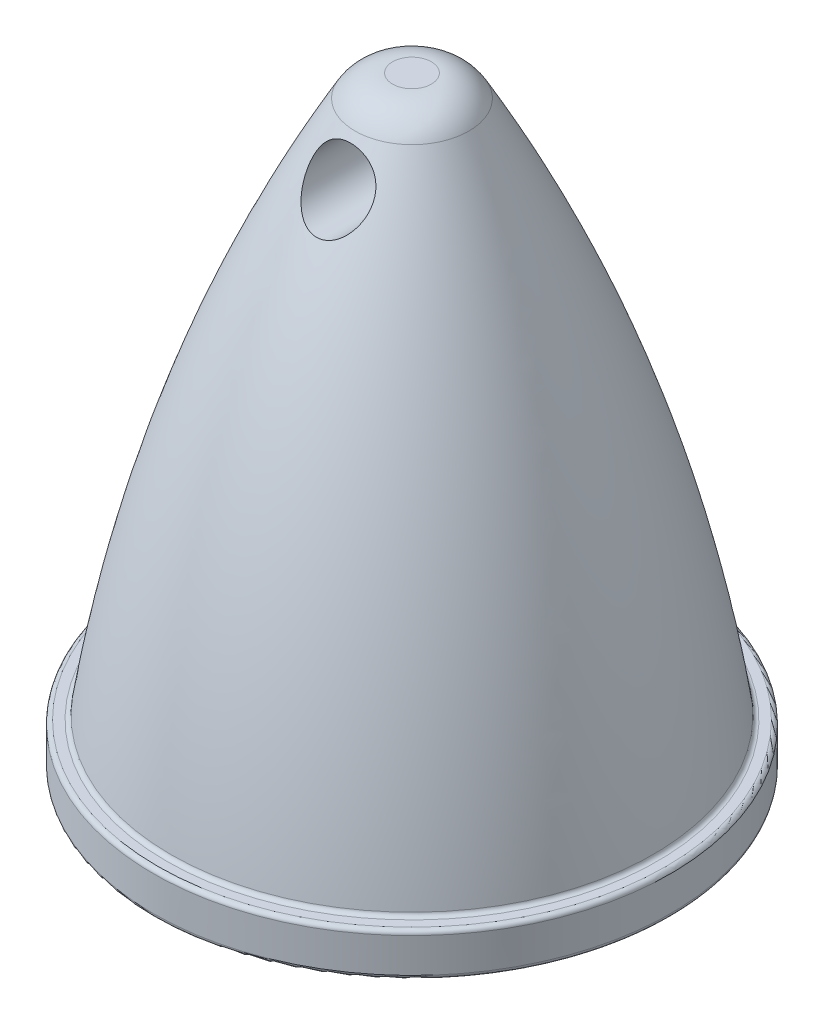
ISO-10303-21;
HEADER;
FILE_DESCRIPTION(('STEP AP214'),'2;1');
FILE_NAME('part.step','',(''),(''),'','','');
FILE_SCHEMA(('AUTOMOTIVE_DESIGN { 1 0 10303 214 1 1 1 1 }'));
ENDSEC;
DATA;
#1=APPLICATION_CONTEXT('core data for automotive mechanical design processes');
#2=APPLICATION_PROTOCOL_DEFINITION('international standard','automotive_design',2000,#1);
#3=PRODUCT_CONTEXT('',#1,'mechanical');
#4=PRODUCT('Part','Part','',(#3));
#5=PRODUCT_RELATED_PRODUCT_CATEGORY('part','',(#4));
#6=PRODUCT_DEFINITION_FORMATION('','',#4);
#7=PRODUCT_DEFINITION_CONTEXT('part definition',#1,'design');
#8=PRODUCT_DEFINITION('design','',#6,#7);
#9=PRODUCT_DEFINITION_SHAPE('','',#8);
#10=(LENGTH_UNIT() NAMED_UNIT(*) SI_UNIT(.MILLI.,.METRE.));
#11=(NAMED_UNIT(*) PLANE_ANGLE_UNIT() SI_UNIT($,.RADIAN.));
#12=(NAMED_UNIT(*) SI_UNIT($,.STERADIAN.) SOLID_ANGLE_UNIT());
#13=UNCERTAINTY_MEASURE_WITH_UNIT(LENGTH_MEASURE(1.E-05),#10,'distance_accuracy_value','');
#14=(GEOMETRIC_REPRESENTATION_CONTEXT(3) GLOBAL_UNCERTAINTY_ASSIGNED_CONTEXT((#13)) GLOBAL_UNIT_ASSIGNED_CONTEXT((#10,
#11,#12)) REPRESENTATION_CONTEXT('',''));
#15=CARTESIAN_POINT('',(0.,0.,0.));
#16=DIRECTION('',(0.,0.,1.));
#17=DIRECTION('',(1.,0.,0.));
#18=AXIS2_PLACEMENT_3D('',#15,#16,#17);
#19=CARTESIAN_POINT('',(-0.422259829022976,15.,0.));
#20=CARTESIAN_POINT('',(-4.47470887618858,8.54370499288755,0.));
#21=CARTESIAN_POINT('',(-5.60875327333653,0.999999999999999,0.));
#22=B_SPLINE_CURVE_WITH_KNOTS('',2,(#19,#20,#21),.UNSPECIFIED.,.F.,.F.,(3,3),(0.,1.),.UNSPECIFIED.);
#23=CARTESIAN_POINT('',(0.,0.,0.));
#24=DIRECTION('',(0.,-1.,0.));
#25=AXIS1_PLACEMENT('',#23,#24);
#26=SURFACE_OF_REVOLUTION('',#22,#25);
#27=CARTESIAN_POINT('',(0.,1.08491154934234,0.));
#28=DIRECTION('',(0.,-1.,0.));
#29=DIRECTION('',(0.,0.,-1.));
#30=AXIS2_PLACEMENT_3D('',#27,#28,#29);
#31=CIRCLE('',#30,5.59589083398633);
#32=CARTESIAN_POINT('',(0.,1.08491154934234,-5.59589083398633));
#33=VERTEX_POINT('',#32);
#34=EDGE_CURVE('E10',#33,#33,#31,.F.);
#35=ORIENTED_EDGE('',*,*,#34,.T.);
#36=EDGE_LOOP('',(#35));
#37=FACE_BOUND('',#36,.T.);
#38=CARTESIAN_POINT('',(0.,13.4915036521533,0.));
#39=DIRECTION('',(0.,-1.,0.));
#40=DIRECTION('',(0.,0.,-1.));
#41=AXIS2_PLACEMENT_3D('',#38,#39,#40);
#42=CIRCLE('',#41,1.32090286343615);
#43=CARTESIAN_POINT('',(0.,13.4915036521533,-1.32090286343615));
#44=VERTEX_POINT('',#43);
#45=EDGE_CURVE('E59',#44,#44,#42,.T.);
#46=ORIENTED_EDGE('',*,*,#45,.T.);
#47=EDGE_LOOP('',(#46));
#48=FACE_BOUND('',#47,.T.);
#49=CARTESIAN_POINT('',(-0.75,12.5540539041216,-1.67174552737872));
#50=CARTESIAN_POINT('',(-0.749999353828348,12.5938845800078,-1.6487466364198));
#51=CARTESIAN_POINT('',(-0.746832961638129,12.6342427908173,-1.62668781142929));
#52=CARTESIAN_POINT('',(-0.73360595861183,12.7153201939884,-1.58532894257153));
#53=CARTESIAN_POINT('',(-0.723543956613366,12.7560394575545,-1.56602945633988));
#54=CARTESIAN_POINT('',(-0.69593615953723,12.8369149990832,-1.53096357108809));
#55=CARTESIAN_POINT('',(-0.678332772013658,12.8770644360082,-1.51522581592038));
#56=CARTESIAN_POINT('',(-0.635562135793221,12.9547008765437,-1.48807760708021));
#57=CARTESIAN_POINT('',(-0.610402724015927,12.9921905891887,-1.47666269746188));
#58=CARTESIAN_POINT('',(-0.556704507212438,13.0581973421592,-1.45920615605375));
#59=CARTESIAN_POINT('',(-0.528978580966332,13.0872502970211,-1.45267191729595));
#60=CARTESIAN_POINT('',(-0.468945978414257,13.1407443687161,-1.44229421663613));
#61=CARTESIAN_POINT('',(-0.436638413058119,13.1651845883143,-1.43845127783241));
#62=CARTESIAN_POINT('',(-0.369144864210763,13.2081164983058,-1.43276013178433));
#63=CARTESIAN_POINT('',(-0.334037456787877,13.2267267893353,-1.43087006445156));
#64=CARTESIAN_POINT('',(-0.261292971608593,13.2581822685724,-1.42820763635817));
#65=CARTESIAN_POINT('',(-0.22365573458093,13.2710270934101,-1.42743534603889));
#66=CARTESIAN_POINT('',(-0.145034557479662,13.2910651729764,-1.42640847738012));
#67=CARTESIAN_POINT('',(-0.103976347818368,13.2979692150738,-1.42617952548427));
#68=CARTESIAN_POINT('',(-0.0212807356614588,13.3048996654319,-1.42594997704841));
#69=CARTESIAN_POINT('',(0.0203567353309801,13.3049252532923,-1.42594940774783));
#70=CARTESIAN_POINT('',(0.103692440362171,13.2980444842171,-1.4261767571169));
#71=CARTESIAN_POINT('',(0.145382046816402,13.2910331520589,-1.42640813587468));
#72=CARTESIAN_POINT('',(0.226995354833834,13.2701180384541,-1.42748392801219));
#73=CARTESIAN_POINT('',(0.266918792790648,13.2562132318891,-1.42832843257763));
#74=CARTESIAN_POINT('',(0.343741482359982,13.2219653923075,-1.43132854385654));
#75=CARTESIAN_POINT('',(0.380647754641604,13.2016378740888,-1.43348100250507));
#76=CARTESIAN_POINT('',(0.450407088734738,13.155208437208,-1.43997179889412));
#77=CARTESIAN_POINT('',(0.483262092716239,13.1291093023427,-1.44430908412191));
#78=CARTESIAN_POINT('',(0.542898360195766,13.0730719126999,-1.45580188356541));
#79=CARTESIAN_POINT('',(0.569844750186876,13.0432894443163,-1.46285929713847));
#80=CARTESIAN_POINT('',(0.618279509935649,12.9804387779743,-1.48024771134155));
#81=CARTESIAN_POINT('',(0.639769332726941,12.9473714580116,-1.49057783882757));
#82=CARTESIAN_POINT('',(0.676332561172423,12.8803732731029,-1.51413448261785));
#83=CARTESIAN_POINT('',(0.691593665084124,12.8465065255111,-1.52725462712253));
#84=CARTESIAN_POINT('',(0.716726710799055,12.7779671611556,-1.55624057235812));
#85=CARTESIAN_POINT('',(0.726596220841697,12.7432941880997,-1.57210760777239));
#86=CARTESIAN_POINT('',(0.741821118881883,12.6710157922298,-1.60750453540109));
#87=CARTESIAN_POINT('',(0.746720043440813,12.633412321489,-1.62723135715125));
#88=CARTESIAN_POINT('',(0.750913411260141,12.5589216165837,-1.66856579990757));
#89=CARTESIAN_POINT('',(0.75020182221468,12.5220351960883,-1.69017542057433));
#90=CARTESIAN_POINT('',(0.742920094189962,12.4424171405507,-1.7388791252113));
#91=CARTESIAN_POINT('',(0.735240398410983,12.3999394568091,-1.76622400990531));
#92=CARTESIAN_POINT('',(0.712921592373033,12.3172375929756,-1.82153432558428));
#93=CARTESIAN_POINT('',(0.698273035155863,12.2770165549722,-1.84950054964848));
#94=CARTESIAN_POINT('',(0.659380733608977,12.1932662721224,-1.90942103467644));
#95=CARTESIAN_POINT('',(0.633992094453037,12.1502081572556,-1.94131253554062));
#96=CARTESIAN_POINT('',(0.589242085002392,12.089375360751,-1.9874361694014));
#97=CARTESIAN_POINT('',(0.573222297670768,12.0697308919062,-2.00251918585258));
#98=CARTESIAN_POINT('',(0.538918297324946,12.0318267198658,-2.0319176407518));
#99=CARTESIAN_POINT('',(0.520631307096153,12.0135687600925,-2.04623210639726));
#100=CARTESIAN_POINT('',(0.473609028034925,11.9713260522573,-2.07963156577399));
#101=CARTESIAN_POINT('',(0.443721254643914,11.9481761997436,-2.0981804320314));
#102=CARTESIAN_POINT('',(0.379603124095857,11.9060827401185,-2.13220238857293));
#103=CARTESIAN_POINT('',(0.345381900790111,11.8871305099636,-2.14768177740377));
#104=CARTESIAN_POINT('',(0.278935421614714,11.8570603322209,-2.1723852422005));
#105=CARTESIAN_POINT('',(0.247288706355247,11.8451699123252,-2.18221695058801));
#106=CARTESIAN_POINT('',(0.181856841946316,11.8256369181349,-2.19841736235532));
#107=CARTESIAN_POINT('',(0.148072857676357,11.8179920517223,-2.2047879343163));
#108=CARTESIAN_POINT('',(0.0790991271602457,11.8074179091257,-2.21360940335951));
#109=CARTESIAN_POINT('',(0.043903660945809,11.8045103481352,-2.21604225008658));
#110=CARTESIAN_POINT('',(-0.0265846829034752,11.8036974457111,-2.21672185285453));
#111=CARTESIAN_POINT('',(-0.061877546151286,11.805791401245,-2.21496919722579));
#112=CARTESIAN_POINT('',(-0.12868928620361,11.8144685411731,-2.20772600776461));
#113=CARTESIAN_POINT('',(-0.160289220843537,11.8206928093938,-2.2025343737849));
#114=CARTESIAN_POINT('',(-0.221858299000813,11.8369105078852,-2.18906033352861));
#115=CARTESIAN_POINT('',(-0.251824642425323,11.8469101905604,-2.1807728004243));
#116=CARTESIAN_POINT('',(-0.311448710449345,11.8709719405062,-2.1609391782689));
#117=CARTESIAN_POINT('',(-0.340954854126071,11.8852590022884,-2.14921378109444));
#118=CARTESIAN_POINT('',(-0.397100496489462,11.9169872874245,-2.12337133290169));
#119=CARTESIAN_POINT('',(-0.423736115666546,11.9344326960704,-2.10925110996133));
#120=CARTESIAN_POINT('',(-0.485690327179989,11.9807133703311,-2.07214422114278));
#121=CARTESIAN_POINT('',(-0.519250669190784,12.01106175576,-2.04809752992122));
#122=CARTESIAN_POINT('',(-0.579677833825023,12.0760875957177,-1.99752913202419));
#123=CARTESIAN_POINT('',(-0.606530995997309,12.1107736727355,-1.97100252303149));
#124=CARTESIAN_POINT('',(-0.653860453203824,12.184060664565,-1.91629982488664));
#125=CARTESIAN_POINT('',(-0.674238459132563,12.2227111243763,-1.88810537353406));
#126=CARTESIAN_POINT('',(-0.707967175162774,12.3027238929479,-1.83157585294889));
#127=CARTESIAN_POINT('',(-0.721329639181897,12.3440815344381,-1.80324109971893));
#128=CARTESIAN_POINT('',(-0.743479685268572,12.4407987745734,-1.73970522741243));
#129=CARTESIAN_POINT('',(-0.750000927482905,12.496882917312,-1.70475700063122));
#130=CARTESIAN_POINT('',(-0.75,12.5540539041216,-1.67174552737872));
#131=B_SPLINE_CURVE_WITH_KNOTS('',3,(#49,#50,#51,#52,#53,#54,#55,#56,#57,#58,#59,#60,#61,#62,
#63,#64,#65,#66,#67,#68,#69,#70,#71,#72,#73,#74,#75,#76,#77,#78,#79,#80,#81,#82,#83,#84,#85,#86,
#87,#88,#89,#90,#91,#92,#93,#94,#95,#96,#97,#98,#99,#100,#101,#102,#103,#104,#105,#106,#107,
#108,#109,#110,#111,#112,#113,#114,#115,#116,#117,#118,#119,#120,#121,#122,#123,#124,#125,#126,
#127,#128,#129,#130),.UNSPECIFIED.,.T.,.F.,(4,2,2,2,2,2,2,2,2,2,2,2,2,2,2,2,2,2,2,2,2,2,2,2,2,2,
2,2,2,2,2,2,2,2,2,2,2,2,2,2,4),(0.,0.137807501859531,0.275642814032796,0.414550063046576,
0.553313735582171,0.674770167194262,0.796250199310051,0.915068582941795,1.0338944540785,
1.15822213001592,1.28256463463783,1.408790038348,1.53503421848351,1.6609757432375,
1.78685665518455,1.90856826237993,2.03024742482331,2.14792677375677,2.26565915565936,
2.39342646101072,2.5213311577912,2.67404431318852,2.82696507833798,3.00387979797206,
3.09226357147933,3.18075670086184,3.30659529890396,3.4321729423182,3.53735480193531,
3.6424798199213,3.74808537531332,3.85367608725437,3.95111809101175,4.04872217985661,
4.15278365594337,4.25698405240248,4.40987345281064,4.56307174806934,4.71849524316472,
4.87365750225975,5.07145959061942),.UNSPECIFIED.);
#132=CARTESIAN_POINT('',(-0.75,12.5540539041216,-1.67174552737872));
#133=VERTEX_POINT('',#132);
#134=EDGE_CURVE('E69',#133,#133,#131,.T.);
#135=ORIENTED_EDGE('',*,*,#134,.F.);
#136=EDGE_LOOP('',(#135));
#137=FACE_BOUND('',#136,.T.);
#138=CARTESIAN_POINT('',(-0.75,12.5540539041216,1.67174552737872));
#139=CARTESIAN_POINT('',(-0.74999997109448,12.4988020503618,1.70365077921063));
#140=CARTESIAN_POINT('',(-0.743902850280342,12.4445112165565,1.73739522999974));
#141=CARTESIAN_POINT('',(-0.720587792645749,12.3391473980764,1.80636501848972));
#142=CARTESIAN_POINT('',(-0.703320546512471,12.2880897886691,1.8415962717694));
#143=CARTESIAN_POINT('',(-0.660289072029363,12.1950419577077,1.908134488975));
#144=CARTESIAN_POINT('',(-0.635479540762415,12.1526507051627,1.93949824693119));
#145=CARTESIAN_POINT('',(-0.577220650882957,12.0726443926146,2.00008679451106));
#146=CARTESIAN_POINT('',(-0.543795420857545,12.0350164247671,2.02931726974797));
#147=CARTESIAN_POINT('',(-0.47854807992584,11.9753640920362,2.07641203741729));
#148=CARTESIAN_POINT('',(-0.448739502311138,11.9518726172238,2.0952116911089));
#149=CARTESIAN_POINT('',(-0.384672668181967,11.9090687367542,2.12977282558785));
#150=CARTESIAN_POINT('',(-0.350419848894242,11.889751300182,2.14553796130888));
#151=CARTESIAN_POINT('',(-0.283944019871743,11.8590824659435,2.17071736813456));
#152=CARTESIAN_POINT('',(-0.252321837242601,11.8469420408128,2.1807507215177));
#153=CARTESIAN_POINT('',(-0.186887574104033,11.8269080863006,2.19735999855181));
#154=CARTESIAN_POINT('',(-0.153076830416604,11.8190119913084,2.20393801083082));
#155=CARTESIAN_POINT('',(-0.083983639845094,11.8079468194145,2.21316730179279));
#156=CARTESIAN_POINT('',(-0.0486949455299019,11.8048004562558,2.21579971174552));
#157=CARTESIAN_POINT('',(0.0220341780593772,11.8035443027934,2.21684987900316));
#158=CARTESIAN_POINT('',(0.0574745821682139,11.8054337072047,2.21526831017843));
#159=CARTESIAN_POINT('',(0.124528232148602,11.8137542116502,2.20832189021084));
#160=CARTESIAN_POINT('',(0.156221945438822,11.8198128436763,2.2032673573755));
#161=CARTESIAN_POINT('',(0.217955642749221,11.8357141121979,2.19005267779114));
#162=CARTESIAN_POINT('',(0.247995418464514,11.8455572240885,2.18189214087645));
#163=CARTESIAN_POINT('',(0.30770126948666,11.8692792146498,2.16233061373736));
#164=CARTESIAN_POINT('',(0.337224410569505,11.8833733889944,2.1507577773333));
#165=CARTESIAN_POINT('',(0.393463083109913,11.9147360224789,2.125197795828));
#166=CARTESIAN_POINT('',(0.420171864785532,11.9320118515986,2.11120504993725));
#167=CARTESIAN_POINT('',(0.482294000427414,11.9778606537436,2.07441455633832));
#168=CARTESIAN_POINT('',(0.51596610811547,12.0079472564798,2.05055165985661));
#169=CARTESIAN_POINT('',(0.576604424684727,12.0724010310196,2.0003670894848));
#170=CARTESIAN_POINT('',(0.603569441920033,12.1067689618595,1.9740449798085));
#171=CARTESIAN_POINT('',(0.651189957854917,12.1794025911112,1.91972872855517));
#172=CARTESIAN_POINT('',(0.671748958254525,12.2177173112629,1.89171596145401));
#173=CARTESIAN_POINT('',(0.705959601418473,12.2971627786654,1.83543260607771));
#174=CARTESIAN_POINT('',(0.719606894347643,12.33829528083,1.80716186681322));
#175=CARTESIAN_POINT('',(0.741269477605407,12.4293918432041,1.74707787251525));
#176=CARTESIAN_POINT('',(0.748082720000518,12.4797361046182,1.71539537365206));
#177=CARTESIAN_POINT('',(0.751213831469034,12.5824382511945,1.65489114168017));
#178=CARTESIAN_POINT('',(0.747549380901219,12.634792597335,1.62606467419059));
#179=CARTESIAN_POINT('',(0.731294127027403,12.7248204738144,1.58080654535464));
#180=CARTESIAN_POINT('',(0.721553544296449,12.7624137373763,1.5631869491946));
#181=CARTESIAN_POINT('',(0.695780866272827,12.8367777476794,1.53110870147471));
#182=CARTESIAN_POINT('',(0.679756098238471,12.8735493998172,1.51664639902351));
#183=CARTESIAN_POINT('',(0.641249345172126,12.9451529795868,1.49125690538221));
#184=CARTESIAN_POINT('',(0.618735337734898,12.9799742391047,1.48034783134));
#185=CARTESIAN_POINT('',(0.567679886690837,13.0459673857849,1.46214784851574));
#186=CARTESIAN_POINT('',(0.539137767739317,13.0771388634439,1.45485734543824));
#187=CARTESIAN_POINT('',(0.47931687030931,13.1322230574558,1.4437940644761));
#188=CARTESIAN_POINT('',(0.448424287655561,13.1565120046899,1.43979156230698));
#189=CARTESIAN_POINT('',(0.383091848751426,13.2000271853121,1.43370417206928));
#190=CARTESIAN_POINT('',(0.3486515786666,13.2192528271379,1.43161950799703));
#191=CARTESIAN_POINT('',(0.276133588598321,13.2525429005919,1.42860491638431));
#192=CARTESIAN_POINT('',(0.237980652303885,13.2664463920239,1.42770923162599));
#193=CARTESIAN_POINT('',(0.159924694963376,13.2879225733839,1.42654136941626));
#194=CARTESIAN_POINT('',(0.120021507775812,13.2954946609326,1.42626925128766));
#195=CARTESIAN_POINT('',(0.0380760551803717,13.3042589514499,1.42596550009276));
#196=CARTESIAN_POINT('',(-0.00399177374678642,13.3052142768476,1.42594277906728));
#197=CARTESIAN_POINT('',(-0.0877009818127603,13.3000883880192,1.42610744241742));
#198=CARTESIAN_POINT('',(-0.129342295085068,13.2940061030281,1.42629485876507));
#199=CARTESIAN_POINT('',(-0.211227317995463,13.2749276293309,1.4272105747062));
#200=CARTESIAN_POINT('',(-0.251462964502277,13.2618968944708,1.42794158415252));
#201=CARTESIAN_POINT('',(-0.329148883886202,13.2292835371528,1.4306140463481));
#202=CARTESIAN_POINT('',(-0.366599232763639,13.2097010935466,1.43255546605623));
#203=CARTESIAN_POINT('',(-0.43716098997874,13.1648859938762,1.43848562976435));
#204=CARTESIAN_POINT('',(-0.470318348002723,13.1397226746708,1.44244996635182));
#205=CARTESIAN_POINT('',(-0.531762428585588,13.0845545292821,1.4532401008573));
#206=CARTESIAN_POINT('',(-0.560052575412457,13.0545531358948,1.46006387534393));
#207=CARTESIAN_POINT('',(-0.60980319964729,12.9924054819617,1.4767228107702));
#208=CARTESIAN_POINT('',(-0.631517697962934,12.9604210413747,1.48640525141671));
#209=CARTESIAN_POINT('',(-0.669434234708961,12.8943621113569,1.50894583682642));
#210=CARTESIAN_POINT('',(-0.685633352643101,12.8602865258617,1.52180565787163));
#211=CARTESIAN_POINT('',(-0.712595166025895,12.7909208417367,1.55050404595326));
#212=CARTESIAN_POINT('',(-0.723313182810029,12.755623190174,1.56636569320768));
#213=CARTESIAN_POINT('',(-0.739366551126371,12.6850022813095,1.60044266650243));
#214=CARTESIAN_POINT('',(-0.744707373155709,12.6496790866914,1.618655579147));
#215=CARTESIAN_POINT('',(-0.749194411601134,12.5943486559069,1.64879361085393));
#216=CARTESIAN_POINT('',(-0.750000010507071,12.574137790179,1.6601480623378));
#217=CARTESIAN_POINT('',(-0.75,12.5540539041216,1.67174552737872));
#218=B_SPLINE_CURVE_WITH_KNOTS('',3,(#138,#139,#140,#141,#142,#143,#144,#145,#146,#147,#148,
#149,#150,#151,#152,#153,#154,#155,#156,#157,#158,#159,#160,#161,#162,#163,#164,#165,#166,#167,
#168,#169,#170,#171,#172,#173,#174,#175,#176,#177,#178,#179,#180,#181,#182,#183,#184,#185,#186,
#187,#188,#189,#190,#191,#192,#193,#194,#195,#196,#197,#198,#199,#200,#201,#202,#203,#204,#205,
#206,#207,#208,#209,#210,#211,#212,#213,#214,#215,#216,#217),.UNSPECIFIED.,.T.,.F.,(4,2,2,2,2,2,
2,2,2,2,2,2,2,2,2,2,2,2,2,2,2,2,2,2,2,2,2,2,2,2,2,2,2,2,2,2,2,2,2,4),(0.,0.191323995814044,
0.383498387937975,0.557552650408451,0.731124665489223,0.857730238447417,0.984182353446042,
1.08972611835265,1.19520601226355,1.30118874232715,1.40715452538251,1.50470780951375,
1.60227335200333,1.70598935200901,1.80994869237914,1.96233769946209,2.11475376212627,
2.26936568651068,2.42407479429809,2.60278281170884,2.78118945015635,2.90861150814878,
3.03588543373111,3.16379849690564,3.29172589811534,3.40969123193459,3.52767034191642,
3.64897844746992,3.7702980931473,3.89593947310316,4.02159997177444,4.14789113272906,
4.27417884640629,4.39897765244517,4.52368829551991,4.64267056337379,4.76171573691593,
4.88171641810255,5.00159489267935,5.0711406014746),.UNSPECIFIED.);
#219=CARTESIAN_POINT('',(-0.75,12.5540539041216,1.67174552737872));
#220=VERTEX_POINT('',#219);
#221=EDGE_CURVE('E60',#220,#220,#218,.T.);
#222=ORIENTED_EDGE('',*,*,#221,.F.);
#223=EDGE_LOOP('',(#222));
#224=FACE_BOUND('',#223,.T.);
#225=ADVANCED_FACE('F33',(#37,#48,#137,#224),#26,.T.);
#226=CARTESIAN_POINT('',(0.,0.,0.));
#227=DIRECTION('',(0.,1.,0.));
#228=DIRECTION('',(0.,0.,1.));
#229=AXIS2_PLACEMENT_3D('',#226,#227,#228);
#230=PLANE('',#229);
#231=CARTESIAN_POINT('',(0.,0.,0.));
#232=DIRECTION('',(0.,-1.,0.));
#233=DIRECTION('',(0.,0.,-1.));
#234=AXIS2_PLACEMENT_3D('',#231,#232,#233);
#235=CIRCLE('',#234,3.);
#236=CARTESIAN_POINT('',(0.,0.,-3.));
#237=VERTEX_POINT('',#236);
#238=EDGE_CURVE('E118',#237,#237,#235,.T.);
#239=ORIENTED_EDGE('',*,*,#238,.F.);
#240=EDGE_LOOP('',(#239));
#241=FACE_BOUND('',#240,.T.);
#242=CARTESIAN_POINT('',(0.,0.,0.));
#243=DIRECTION('',(0.,1.,0.));
#244=DIRECTION('',(0.,0.,1.));
#245=AXIS2_PLACEMENT_3D('',#242,#243,#244);
#246=CIRCLE('',#245,5.9);
#247=CARTESIAN_POINT('',(0.,0.,5.9));
#248=VERTEX_POINT('',#247);
#249=EDGE_CURVE('E56',#248,#248,#246,.F.);
#250=ORIENTED_EDGE('',*,*,#249,.T.);
#251=EDGE_LOOP('',(#250));
#252=FACE_BOUND('',#251,.T.);
#253=ADVANCED_FACE('F98',(#241,#252),#230,.F.);
#254=CARTESIAN_POINT('',(-6.,0.999999999999999,0.));
#255=DIRECTION('',(0.,-1.,0.));
#256=DIRECTION('',(0.,0.,-1.));
#257=AXIS2_PLACEMENT_3D('',#254,#255,#256);
#258=PLANE('',#257);
#259=CARTESIAN_POINT('',(0.,0.999999999999999,0.));
#260=DIRECTION('',(0.,-1.,0.));
#261=DIRECTION('',(0.,0.,-1.));
#262=AXIS2_PLACEMENT_3D('',#259,#260,#261);
#263=CIRCLE('',#262,5.69474597374523);
#264=CARTESIAN_POINT('',(0.,0.999999999999999,-5.69474597374523));
#265=VERTEX_POINT('',#264);
#266=EDGE_CURVE('E40',#265,#265,#263,.T.);
#267=ORIENTED_EDGE('',*,*,#266,.T.);
#268=EDGE_LOOP('',(#267));
#269=FACE_BOUND('',#268,.T.);
#270=CARTESIAN_POINT('',(0.,0.999999999999999,0.));
#271=DIRECTION('',(0.,-1.,0.));
#272=DIRECTION('',(0.,0.,-1.));
#273=AXIS2_PLACEMENT_3D('',#270,#271,#272);
#274=CIRCLE('',#273,5.9);
#275=CARTESIAN_POINT('',(0.,0.999999999999999,-5.9));
#276=VERTEX_POINT('',#275);
#277=EDGE_CURVE('E44',#276,#276,#274,.F.);
#278=ORIENTED_EDGE('',*,*,#277,.T.);
#279=EDGE_LOOP('',(#278));
#280=FACE_BOUND('',#279,.T.);
#281=ADVANCED_FACE('F95',(#269,#280),#258,.F.);
#282=CARTESIAN_POINT('',(0.,0.,0.));
#283=DIRECTION('',(0.,-1.,0.));
#284=DIRECTION('',(0.,0.,-1.));
#285=AXIS2_PLACEMENT_3D('',#282,#283,#284);
#286=CYLINDRICAL_SURFACE('',#285,6.);
#287=CARTESIAN_POINT('',(0.,0.0999999999999996,0.));
#288=DIRECTION('',(0.,1.,0.));
#289=DIRECTION('',(0.,0.,1.));
#290=AXIS2_PLACEMENT_3D('',#287,#288,#289);
#291=CIRCLE('',#290,6.);
#292=CARTESIAN_POINT('',(0.,0.0999999999999996,6.));
#293=VERTEX_POINT('',#292);
#294=EDGE_CURVE('E48',#293,#293,#291,.T.);
#295=ORIENTED_EDGE('',*,*,#294,.T.);
#296=EDGE_LOOP('',(#295));
#297=FACE_BOUND('',#296,.T.);
#298=CARTESIAN_POINT('',(0.,0.899999999999999,0.));
#299=DIRECTION('',(0.,-1.,0.));
#300=DIRECTION('',(0.,0.,-1.));
#301=AXIS2_PLACEMENT_3D('',#298,#299,#300);
#302=CIRCLE('',#301,6.);
#303=CARTESIAN_POINT('',(0.,0.899999999999999,-6.));
#304=VERTEX_POINT('',#303);
#305=EDGE_CURVE('E53',#304,#304,#302,.T.);
#306=ORIENTED_EDGE('',*,*,#305,.T.);
#307=EDGE_LOOP('',(#306));
#308=FACE_BOUND('',#307,.T.);
#309=ADVANCED_FACE('F92',(#297,#308),#286,.T.);
#310=CARTESIAN_POINT('',(0.,14.,0.));
#311=DIRECTION('',(0.,1.,0.));
#312=DIRECTION('',(0.,0.,1.));
#313=AXIS2_PLACEMENT_3D('',#310,#311,#312);
#314=PLANE('',#313);
#315=CARTESIAN_POINT('',(0.,14.,0.));
#316=DIRECTION('',(0.,1.,0.));
#317=DIRECTION('',(0.,0.,1.));
#318=AXIS2_PLACEMENT_3D('',#315,#316,#317);
#319=CIRCLE('',#318,0.450027349990071);
#320=CARTESIAN_POINT('',(0.,14.,0.450027349990071));
#321=VERTEX_POINT('',#320);
#322=EDGE_CURVE('E68',#321,#321,#319,.T.);
#323=ORIENTED_EDGE('',*,*,#322,.T.);
#324=EDGE_LOOP('',(#323));
#325=FACE_BOUND('',#324,.T.);
#326=ADVANCED_FACE('F88',(#325),#314,.T.);
#327=CARTESIAN_POINT('',(0.,13.,0.));
#328=DIRECTION('',(0.,-1.,0.));
#329=DIRECTION('',(0.,0.,-1.));
#330=AXIS2_PLACEMENT_3D('',#327,#328,#329);
#331=DEGENERATE_TOROIDAL_SURFACE('',#330,0.450027349990071,1.,.T.);
#332=ORIENTED_EDGE('',*,*,#45,.F.);
#333=EDGE_LOOP('',(#332));
#334=FACE_BOUND('',#333,.T.);
#335=ORIENTED_EDGE('',*,*,#322,.F.);
#336=EDGE_LOOP('',(#335));
#337=FACE_BOUND('',#336,.T.);
#338=ADVANCED_FACE('F84',(#334,#337),#331,.T.);
#339=CARTESIAN_POINT('',(0.,12.5540539041216,10.));
#340=DIRECTION('',(0.,0.,-1.));
#341=DIRECTION('',(-1.,0.,0.));
#342=AXIS2_PLACEMENT_3D('',#339,#340,#341);
#343=CYLINDRICAL_SURFACE('',#342,0.75);
#344=ORIENTED_EDGE('',*,*,#134,.T.);
#345=EDGE_LOOP('',(#344));
#346=FACE_BOUND('',#345,.T.);
#347=ORIENTED_EDGE('',*,*,#221,.T.);
#348=EDGE_LOOP('',(#347));
#349=FACE_BOUND('',#348,.T.);
#350=ADVANCED_FACE('F78',(#346,#349),#343,.F.);
#351=CARTESIAN_POINT('',(0.,0.0999999999999996,0.));
#352=DIRECTION('',(0.,1.,0.));
#353=DIRECTION('',(0.,0.,1.));
#354=AXIS2_PLACEMENT_3D('',#351,#352,#353);
#355=TOROIDAL_SURFACE('',#354,5.9,0.1);
#356=ORIENTED_EDGE('',*,*,#294,.F.);
#357=EDGE_LOOP('',(#356));
#358=FACE_BOUND('',#357,.T.);
#359=ORIENTED_EDGE('',*,*,#249,.F.);
#360=EDGE_LOOP('',(#359));
#361=FACE_BOUND('',#360,.T.);
#362=ADVANCED_FACE('F83',(#358,#361),#355,.T.);
#363=CARTESIAN_POINT('',(0.,1.1,0.));
#364=DIRECTION('',(0.,-1.,0.));
#365=DIRECTION('',(0.,0.,-1.));
#366=AXIS2_PLACEMENT_3D('',#363,#364,#365);
#367=TOROIDAL_SURFACE('',#366,5.69474597374523,0.1);
#368=ORIENTED_EDGE('',*,*,#34,.F.);
#369=EDGE_LOOP('',(#368));
#370=FACE_BOUND('',#369,.T.);
#371=ORIENTED_EDGE('',*,*,#266,.F.);
#372=EDGE_LOOP('',(#371));
#373=FACE_BOUND('',#372,.T.);
#374=ADVANCED_FACE('F141',(#370,#373),#367,.F.);
#375=CARTESIAN_POINT('',(0.,0.899999999999999,0.));
#376=DIRECTION('',(0.,-1.,0.));
#377=DIRECTION('',(0.,0.,-1.));
#378=AXIS2_PLACEMENT_3D('',#375,#376,#377);
#379=TOROIDAL_SURFACE('',#378,5.9,0.1);
#380=ORIENTED_EDGE('',*,*,#277,.F.);
#381=EDGE_LOOP('',(#380));
#382=FACE_BOUND('',#381,.T.);
#383=ORIENTED_EDGE('',*,*,#305,.F.);
#384=EDGE_LOOP('',(#383));
#385=FACE_BOUND('',#384,.T.);
#386=ADVANCED_FACE('F35',(#382,#385),#379,.T.);
#387=CARTESIAN_POINT('',(0.,10.,0.));
#388=DIRECTION('',(0.,-1.,0.));
#389=DIRECTION('',(0.,0.,-1.));
#390=AXIS2_PLACEMENT_3D('',#387,#388,#389);
#391=CYLINDRICAL_SURFACE('',#390,3.);
#392=CARTESIAN_POINT('',(0.,10.,0.));
#393=DIRECTION('',(0.,-1.,0.));
#394=DIRECTION('',(0.,0.,-1.));
#395=AXIS2_PLACEMENT_3D('',#392,#393,#394);
#396=CIRCLE('',#395,3.);
#397=CARTESIAN_POINT('',(0.,10.,-3.));
#398=VERTEX_POINT('',#397);
#399=EDGE_CURVE('E116',#398,#398,#396,.T.);
#400=ORIENTED_EDGE('',*,*,#399,.F.);
#401=EDGE_LOOP('',(#400));
#402=FACE_BOUND('',#401,.T.);
#403=ORIENTED_EDGE('',*,*,#238,.T.);
#404=EDGE_LOOP('',(#403));
#405=FACE_BOUND('',#404,.T.);
#406=ADVANCED_FACE('F86',(#402,#405),#391,.F.);
#407=CARTESIAN_POINT('',(0.,10.,0.));
#408=DIRECTION('',(0.,-1.,0.));
#409=DIRECTION('',(0.,0.,-1.));
#410=AXIS2_PLACEMENT_3D('',#407,#408,#409);
#411=PLANE('',#410);
#412=ORIENTED_EDGE('',*,*,#399,.T.);
#413=EDGE_LOOP('',(#412));
#414=FACE_BOUND('',#413,.T.);
#415=ADVANCED_FACE('F153',(#414),#411,.T.);
#416=CLOSED_SHELL('',(#225,#253,#281,#309,#326,#338,#350,#362,#374,#386,#406,#415));
#417=MANIFOLD_SOLID_BREP('B2',#416);
#418=ADVANCED_BREP_SHAPE_REPRESENTATION('',(#18,#417),#14);
#419=SHAPE_DEFINITION_REPRESENTATION(#9,#418);
ENDSEC;
END-ISO-10303-21;
